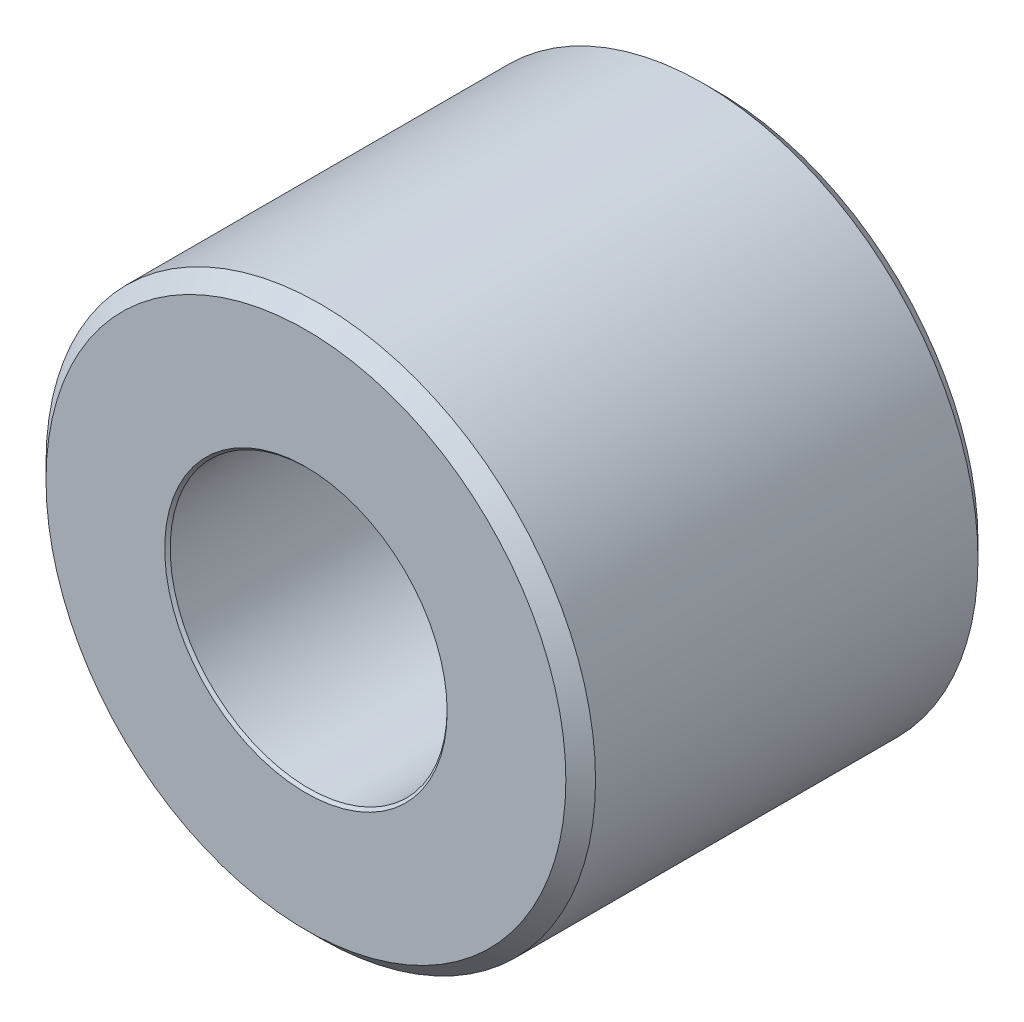
ISO-10303-21;
HEADER;
FILE_DESCRIPTION(('STEP AP214'),'2;1');
FILE_NAME('part.step','',(''),(''),'','','');
FILE_SCHEMA(('AUTOMOTIVE_DESIGN { 1 0 10303 214 1 1 1 1 }'));
ENDSEC;
DATA;
#1=APPLICATION_CONTEXT('core data for automotive mechanical design processes');
#2=APPLICATION_PROTOCOL_DEFINITION('international standard','automotive_design',2000,#1);
#3=PRODUCT_CONTEXT('',#1,'mechanical');
#4=PRODUCT('Part','Part','',(#3));
#5=PRODUCT_RELATED_PRODUCT_CATEGORY('part','',(#4));
#6=PRODUCT_DEFINITION_FORMATION('','',#4);
#7=PRODUCT_DEFINITION_CONTEXT('part definition',#1,'design');
#8=PRODUCT_DEFINITION('design','',#6,#7);
#9=PRODUCT_DEFINITION_SHAPE('','',#8);
#10=(LENGTH_UNIT() NAMED_UNIT(*) SI_UNIT(.MILLI.,.METRE.));
#11=(NAMED_UNIT(*) PLANE_ANGLE_UNIT() SI_UNIT($,.RADIAN.));
#12=(NAMED_UNIT(*) SI_UNIT($,.STERADIAN.) SOLID_ANGLE_UNIT());
#13=UNCERTAINTY_MEASURE_WITH_UNIT(LENGTH_MEASURE(1.E-05),#10,'distance_accuracy_value','');
#14=(GEOMETRIC_REPRESENTATION_CONTEXT(3) GLOBAL_UNCERTAINTY_ASSIGNED_CONTEXT((#13)) GLOBAL_UNIT_ASSIGNED_CONTEXT((#10,
#11,#12)) REPRESENTATION_CONTEXT('',''));
#15=CARTESIAN_POINT('',(0.,0.,0.));
#16=DIRECTION('',(0.,0.,1.));
#17=DIRECTION('',(1.,0.,0.));
#18=AXIS2_PLACEMENT_3D('',#15,#16,#17);
#19=CARTESIAN_POINT('',(0.,0.,-2.38125));
#20=DIRECTION('',(0.,0.,1.));
#21=DIRECTION('',(1.,0.,0.));
#22=AXIS2_PLACEMENT_3D('',#19,#20,#21);
#23=CYLINDRICAL_SURFACE('',#22,3.175);
#24=CARTESIAN_POINT('',(0.,0.,2.2098));
#25=DIRECTION('',(0.,0.,1.));
#26=DIRECTION('',(1.,0.,0.));
#27=AXIS2_PLACEMENT_3D('',#24,#25,#26);
#28=CIRCLE('',#27,3.175);
#29=CARTESIAN_POINT('',(3.175,0.,2.2098));
#30=VERTEX_POINT('',#29);
#31=EDGE_CURVE('E44',#30,#30,#28,.F.);
#32=ORIENTED_EDGE('',*,*,#31,.T.);
#33=EDGE_LOOP('',(#32));
#34=FACE_BOUND('',#33,.T.);
#35=CARTESIAN_POINT('',(0.,0.,-2.2098));
#36=DIRECTION('',(0.,0.,1.));
#37=DIRECTION('',(1.,0.,0.));
#38=AXIS2_PLACEMENT_3D('',#35,#36,#37);
#39=CIRCLE('',#38,3.175);
#40=CARTESIAN_POINT('',(3.175,0.,-2.2098));
#41=VERTEX_POINT('',#40);
#42=EDGE_CURVE('E49',#41,#41,#39,.T.);
#43=ORIENTED_EDGE('',*,*,#42,.T.);
#44=EDGE_LOOP('',(#43));
#45=FACE_BOUND('',#44,.T.);
#46=ADVANCED_FACE('F32',(#34,#45),#23,.T.);
#47=CARTESIAN_POINT('',(0.,0.,-2.38125));
#48=DIRECTION('',(0.,0.,1.));
#49=DIRECTION('',(1.,0.,0.));
#50=AXIS2_PLACEMENT_3D('',#47,#48,#49);
#51=PLANE('',#50);
#52=CARTESIAN_POINT('',(0.,0.,-2.38125));
#53=DIRECTION('',(0.,0.,1.));
#54=DIRECTION('',(1.,0.,0.));
#55=AXIS2_PLACEMENT_3D('',#52,#53,#54);
#56=CIRCLE('',#55,3.00355);
#57=CARTESIAN_POINT('',(3.00355,0.,-2.38125));
#58=VERTEX_POINT('',#57);
#59=EDGE_CURVE('E10',#58,#58,#56,.F.);
#60=ORIENTED_EDGE('',*,*,#59,.T.);
#61=EDGE_LOOP('',(#60));
#62=FACE_BOUND('',#61,.T.);
#63=CARTESIAN_POINT('',(0.,0.,-2.38125));
#64=DIRECTION('',(0.,0.,1.));
#65=DIRECTION('',(1.,0.,0.));
#66=AXIS2_PLACEMENT_3D('',#63,#64,#65);
#67=CIRCLE('',#66,1.63195);
#68=CARTESIAN_POINT('',(1.63195,0.,-2.38125));
#69=VERTEX_POINT('',#68);
#70=EDGE_CURVE('E40',#69,#69,#67,.T.);
#71=ORIENTED_EDGE('',*,*,#70,.T.);
#72=EDGE_LOOP('',(#71));
#73=FACE_BOUND('',#72,.T.);
#74=ADVANCED_FACE('F72',(#62,#73),#51,.F.);
#75=CARTESIAN_POINT('',(0.,0.,2.38125));
#76=DIRECTION('',(0.,0.,1.));
#77=DIRECTION('',(1.,0.,0.));
#78=AXIS2_PLACEMENT_3D('',#75,#76,#77);
#79=PLANE('',#78);
#80=CARTESIAN_POINT('',(0.,0.,2.38125));
#81=DIRECTION('',(0.,0.,1.));
#82=DIRECTION('',(1.,0.,0.));
#83=AXIS2_PLACEMENT_3D('',#80,#81,#82);
#84=CIRCLE('',#83,3.00355);
#85=CARTESIAN_POINT('',(3.00355,0.,2.38125));
#86=VERTEX_POINT('',#85);
#87=EDGE_CURVE('E52',#86,#86,#84,.T.);
#88=ORIENTED_EDGE('',*,*,#87,.T.);
#89=EDGE_LOOP('',(#88));
#90=FACE_BOUND('',#89,.T.);
#91=CARTESIAN_POINT('',(0.,0.,2.38125));
#92=DIRECTION('',(0.,0.,1.));
#93=DIRECTION('',(1.,0.,0.));
#94=AXIS2_PLACEMENT_3D('',#91,#92,#93);
#95=CIRCLE('',#94,1.63195);
#96=CARTESIAN_POINT('',(1.63195,0.,2.38125));
#97=VERTEX_POINT('',#96);
#98=EDGE_CURVE('E55',#97,#97,#95,.F.);
#99=ORIENTED_EDGE('',*,*,#98,.T.);
#100=EDGE_LOOP('',(#99));
#101=FACE_BOUND('',#100,.T.);
#102=ADVANCED_FACE('F74',(#90,#101),#79,.T.);
#103=CARTESIAN_POINT('',(0.,0.,2.38125));
#104=DIRECTION('',(0.,0.,-1.));
#105=DIRECTION('',(-1.,0.,0.));
#106=AXIS2_PLACEMENT_3D('',#103,#104,#105);
#107=CONICAL_SURFACE('',#106,3.00355,0.785398163397445);
#108=ORIENTED_EDGE('',*,*,#31,.F.);
#109=EDGE_LOOP('',(#108));
#110=FACE_BOUND('',#109,.T.);
#111=ORIENTED_EDGE('',*,*,#87,.F.);
#112=EDGE_LOOP('',(#111));
#113=FACE_BOUND('',#112,.T.);
#114=ADVANCED_FACE('F80',(#110,#113),#107,.T.);
#115=CARTESIAN_POINT('',(0.,0.,-2.2098));
#116=DIRECTION('',(0.,0.,1.));
#117=DIRECTION('',(1.,0.,0.));
#118=AXIS2_PLACEMENT_3D('',#115,#116,#117);
#119=CONICAL_SURFACE('',#118,3.175,0.785398163397448);
#120=ORIENTED_EDGE('',*,*,#59,.F.);
#121=EDGE_LOOP('',(#120));
#122=FACE_BOUND('',#121,.T.);
#123=ORIENTED_EDGE('',*,*,#42,.F.);
#124=EDGE_LOOP('',(#123));
#125=FACE_BOUND('',#124,.T.);
#126=ADVANCED_FACE('F89',(#122,#125),#119,.T.);
#127=CARTESIAN_POINT('',(0.,0.,2.2098));
#128=DIRECTION('',(0.,0.,1.));
#129=DIRECTION('',(1.,0.,0.));
#130=AXIS2_PLACEMENT_3D('',#127,#128,#129);
#131=CONICAL_SURFACE('',#130,1.4605,0.785398163397448);
#132=CARTESIAN_POINT('',(0.,0.,2.3495));
#133=DIRECTION('',(0.,0.,1.));
#134=DIRECTION('',(1.,0.,0.));
#135=AXIS2_PLACEMENT_3D('',#132,#133,#134);
#136=CIRCLE('',#135,1.6002);
#137=CARTESIAN_POINT('',(1.6002,0.,2.3495));
#138=VERTEX_POINT('',#137);
#139=EDGE_CURVE('E58',#138,#138,#136,.T.);
#140=CARTESIAN_POINT('',(1.6002,0.,2.3495));
#141=CARTESIAN_POINT('',(1.60053072916667,0.,2.34983072916667));
#142=CARTESIAN_POINT('',(1.60086145833333,0.,2.35016145833333));
#143=CARTESIAN_POINT('',(1.60152291666667,0.,2.35082291666667));
#144=CARTESIAN_POINT('',(1.60185364583333,0.,2.35115364583333));
#145=CARTESIAN_POINT('',(1.60251510416667,0.,2.35181510416667));
#146=CARTESIAN_POINT('',(1.60284583333333,0.,2.35214583333333));
#147=CARTESIAN_POINT('',(1.60350729166667,0.,2.35280729166667));
#148=CARTESIAN_POINT('',(1.60383802083333,0.,2.35313802083333));
#149=CARTESIAN_POINT('',(1.60449947916667,0.,2.35379947916667));
#150=CARTESIAN_POINT('',(1.60483020833333,0.,2.35413020833333));
#151=CARTESIAN_POINT('',(1.60549166666667,0.,2.35479166666667));
#152=CARTESIAN_POINT('',(1.60582239583333,0.,2.35512239583333));
#153=CARTESIAN_POINT('',(1.60648385416667,0.,2.35578385416667));
#154=CARTESIAN_POINT('',(1.60681458333333,0.,2.35611458333333));
#155=CARTESIAN_POINT('',(1.60747604166667,0.,2.35677604166667));
#156=CARTESIAN_POINT('',(1.60780677083333,0.,2.35710677083333));
#157=CARTESIAN_POINT('',(1.60846822916667,0.,2.35776822916667));
#158=CARTESIAN_POINT('',(1.60879895833333,0.,2.35809895833333));
#159=CARTESIAN_POINT('',(1.60946041666667,0.,2.35876041666667));
#160=CARTESIAN_POINT('',(1.60979114583333,0.,2.35909114583333));
#161=CARTESIAN_POINT('',(1.61045260416667,0.,2.35975260416667));
#162=CARTESIAN_POINT('',(1.61078333333333,0.,2.36008333333333));
#163=CARTESIAN_POINT('',(1.61144479166667,0.,2.36074479166667));
#164=CARTESIAN_POINT('',(1.61177552083333,0.,2.36107552083333));
#165=CARTESIAN_POINT('',(1.61243697916667,0.,2.36173697916667));
#166=CARTESIAN_POINT('',(1.61276770833333,0.,2.36206770833333));
#167=CARTESIAN_POINT('',(1.61342916666667,0.,2.36272916666667));
#168=CARTESIAN_POINT('',(1.61375989583333,0.,2.36305989583333));
#169=CARTESIAN_POINT('',(1.61442135416667,0.,2.36372135416667));
#170=CARTESIAN_POINT('',(1.61475208333333,0.,2.36405208333333));
#171=CARTESIAN_POINT('',(1.61541354166667,0.,2.36471354166667));
#172=CARTESIAN_POINT('',(1.61574427083333,0.,2.36504427083333));
#173=CARTESIAN_POINT('',(1.61640572916667,0.,2.36570572916667));
#174=CARTESIAN_POINT('',(1.61673645833333,0.,2.36603645833333));
#175=CARTESIAN_POINT('',(1.61739791666667,0.,2.36669791666667));
#176=CARTESIAN_POINT('',(1.61772864583333,0.,2.36702864583333));
#177=CARTESIAN_POINT('',(1.61839010416667,0.,2.36769010416667));
#178=CARTESIAN_POINT('',(1.61872083333333,0.,2.36802083333333));
#179=CARTESIAN_POINT('',(1.61938229166667,0.,2.36868229166667));
#180=CARTESIAN_POINT('',(1.61971302083333,0.,2.36901302083333));
#181=CARTESIAN_POINT('',(1.62037447916667,0.,2.36967447916667));
#182=CARTESIAN_POINT('',(1.62070520833333,0.,2.37000520833333));
#183=CARTESIAN_POINT('',(1.62136666666667,0.,2.37066666666667));
#184=CARTESIAN_POINT('',(1.62169739583333,0.,2.37099739583333));
#185=CARTESIAN_POINT('',(1.62235885416667,0.,2.37165885416667));
#186=CARTESIAN_POINT('',(1.62268958333333,0.,2.37198958333333));
#187=CARTESIAN_POINT('',(1.62335104166667,0.,2.37265104166667));
#188=CARTESIAN_POINT('',(1.62368177083333,0.,2.37298177083333));
#189=CARTESIAN_POINT('',(1.62434322916667,0.,2.37364322916667));
#190=CARTESIAN_POINT('',(1.62467395833333,0.,2.37397395833333));
#191=CARTESIAN_POINT('',(1.62533541666667,0.,2.37463541666667));
#192=CARTESIAN_POINT('',(1.62566614583333,0.,2.37496614583333));
#193=CARTESIAN_POINT('',(1.62632760416667,0.,2.37562760416667));
#194=CARTESIAN_POINT('',(1.62665833333333,0.,2.37595833333333));
#195=CARTESIAN_POINT('',(1.62731979166667,0.,2.37661979166667));
#196=CARTESIAN_POINT('',(1.62765052083333,0.,2.37695052083333));
#197=CARTESIAN_POINT('',(1.62831197916667,0.,2.37761197916667));
#198=CARTESIAN_POINT('',(1.62864270833333,0.,2.37794270833333));
#199=CARTESIAN_POINT('',(1.62930416666667,0.,2.37860416666667));
#200=CARTESIAN_POINT('',(1.62963489583333,0.,2.37893489583333));
#201=CARTESIAN_POINT('',(1.63029635416667,0.,2.37959635416667));
#202=CARTESIAN_POINT('',(1.63062708333333,0.,2.37992708333333));
#203=CARTESIAN_POINT('',(1.63128854166667,0.,2.38058854166667));
#204=CARTESIAN_POINT('',(1.63161927083333,0.,2.38091927083333));
#205=CARTESIAN_POINT('',(1.63195,0.,2.38125));
#206=B_SPLINE_CURVE_WITH_KNOTS('',3,(#140,#141,#142,#143,#144,#145,#146,#147,#148,#149,#150,
#151,#152,#153,#154,#155,#156,#157,#158,#159,#160,#161,#162,#163,#164,#165,#166,#167,#168,#169,
#170,#171,#172,#173,#174,#175,#176,#177,#178,#179,#180,#181,#182,#183,#184,#185,#186,#187,#188,
#189,#190,#191,#192,#193,#194,#195,#196,#197,#198,#199,#200,#201,#202,#203,#204,#205),
.UNSPECIFIED.,.F.,.F.,(4,2,2,2,2,2,2,2,2,2,2,2,2,2,2,2,2,2,2,2,2,2,2,2,2,2,2,2,2,2,2,2,4),(0.,
0.00140316501891708,0.002806330037834,0.00420949505675093,0.00561266007566785,
0.00701582509458493,0.00841899011350217,0.00982215513241909,0.0112253201513362,
0.0126284851702531,0.01403165018917,0.0154348152080871,0.016837980227004,0.0182411452459213,
0.0196443102648383,0.0210474752837553,0.0224506403026722,0.0238538053215891,0.0252569703405062,
0.0266601353594231,0.0280633003783403,0.0294664653972574,0.0308696304161743,0.0322727954350913,
0.0336759604540082,0.0350791254729253,0.0364822904918422,0.0378854555107596,0.0392886205296765,
0.0406917855485934,0.0420949505675104,0.0434981155864275,0.0449012806053444),.UNSPECIFIED.);
#207=EDGE_CURVE('BSEAM69',#138,#97,#206,.T.);
#208=ORIENTED_EDGE('',*,*,#139,.F.);
#209=ORIENTED_EDGE('',*,*,#98,.F.);
#210=ORIENTED_EDGE('',*,*,#207,.T.);
#211=ORIENTED_EDGE('',*,*,#207,.F.);
#212=EDGE_LOOP('',(#208,#210,#209,#211));
#213=FACE_BOUND('',#212,.T.);
#214=ADVANCED_FACE('F69',(#213),#131,.F.);
#215=CARTESIAN_POINT('',(0.,0.,-2.38125));
#216=DIRECTION('',(0.,0.,-1.));
#217=DIRECTION('',(-1.,0.,0.));
#218=AXIS2_PLACEMENT_3D('',#215,#216,#217);
#219=CONICAL_SURFACE('',#218,1.63195,0.785398163397446);
#220=CARTESIAN_POINT('',(0.,0.,-2.3495));
#221=DIRECTION('',(0.,0.,-1.));
#222=DIRECTION('',(-1.,0.,0.));
#223=AXIS2_PLACEMENT_3D('',#220,#221,#222);
#224=CIRCLE('',#223,1.6002);
#225=CARTESIAN_POINT('',(-1.6002,0.,-2.3495));
#226=VERTEX_POINT('',#225);
#227=EDGE_CURVE('E36',#226,#226,#224,.T.);
#228=ORIENTED_EDGE('',*,*,#227,.F.);
#229=EDGE_LOOP('',(#228));
#230=FACE_BOUND('',#229,.T.);
#231=ORIENTED_EDGE('',*,*,#70,.F.);
#232=EDGE_LOOP('',(#231));
#233=FACE_BOUND('',#232,.T.);
#234=ADVANCED_FACE('F34',(#230,#233),#219,.F.);
#235=CARTESIAN_POINT('',(0.,0.,-2.38125));
#236=DIRECTION('',(0.,0.,1.));
#237=DIRECTION('',(1.,0.,0.));
#238=AXIS2_PLACEMENT_3D('',#235,#236,#237);
#239=CYLINDRICAL_SURFACE('',#238,1.6002);
#240=ORIENTED_EDGE('',*,*,#139,.T.);
#241=EDGE_LOOP('',(#240));
#242=FACE_BOUND('',#241,.T.);
#243=ORIENTED_EDGE('',*,*,#227,.T.);
#244=EDGE_LOOP('',(#243));
#245=FACE_BOUND('',#244,.T.);
#246=ADVANCED_FACE('F65',(#242,#245),#239,.F.);
#247=CLOSED_SHELL('',(#46,#74,#102,#114,#126,#214,#234,#246));
#248=MANIFOLD_SOLID_BREP('B2',#247);
#249=ADVANCED_BREP_SHAPE_REPRESENTATION('',(#18,#248),#14);
#250=SHAPE_DEFINITION_REPRESENTATION(#9,#249);
ENDSEC;
END-ISO-10303-21;
